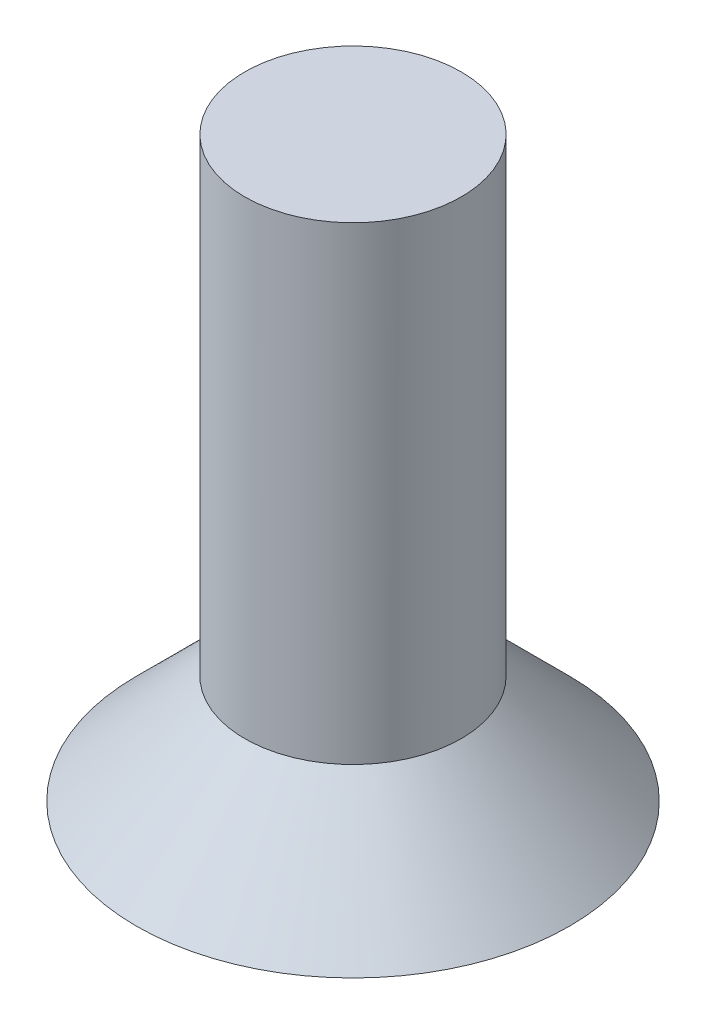
ISO-10303-21;
HEADER;
FILE_DESCRIPTION(('STEP AP214'),'2;1');
FILE_NAME('part.step','',(''),(''),'','','');
FILE_SCHEMA(('AUTOMOTIVE_DESIGN { 1 0 10303 214 1 1 1 1 }'));
ENDSEC;
DATA;
#1=APPLICATION_CONTEXT('core data for automotive mechanical design processes');
#2=APPLICATION_PROTOCOL_DEFINITION('international standard','automotive_design',2000,#1);
#3=PRODUCT_CONTEXT('',#1,'mechanical');
#4=PRODUCT('Part','Part','',(#3));
#5=PRODUCT_RELATED_PRODUCT_CATEGORY('part','',(#4));
#6=PRODUCT_DEFINITION_FORMATION('','',#4);
#7=PRODUCT_DEFINITION_CONTEXT('part definition',#1,'design');
#8=PRODUCT_DEFINITION('design','',#6,#7);
#9=PRODUCT_DEFINITION_SHAPE('','',#8);
#10=(LENGTH_UNIT() NAMED_UNIT(*) SI_UNIT(.MILLI.,.METRE.));
#11=(NAMED_UNIT(*) PLANE_ANGLE_UNIT() SI_UNIT($,.RADIAN.));
#12=(NAMED_UNIT(*) SI_UNIT($,.STERADIAN.) SOLID_ANGLE_UNIT());
#13=UNCERTAINTY_MEASURE_WITH_UNIT(LENGTH_MEASURE(1.E-05),#10,'distance_accuracy_value','');
#14=(GEOMETRIC_REPRESENTATION_CONTEXT(3) GLOBAL_UNCERTAINTY_ASSIGNED_CONTEXT((#13)) GLOBAL_UNIT_ASSIGNED_CONTEXT((#10,
#11,#12)) REPRESENTATION_CONTEXT('',''));
#15=CARTESIAN_POINT('',(0.,0.,0.));
#16=DIRECTION('',(0.,0.,1.));
#17=DIRECTION('',(1.,0.,0.));
#18=AXIS2_PLACEMENT_3D('',#15,#16,#17);
#19=CARTESIAN_POINT('',(0.,0.,0.));
#20=DIRECTION('',(0.,1.,0.));
#21=DIRECTION('',(0.,0.,1.));
#22=AXIS2_PLACEMENT_3D('',#19,#20,#21);
#23=PLANE('',#22);
#24=DIRECTION('',(0.0982131275601408,0.,0.995165404128809));
#25=VECTOR('',#24,1.);
#26=CARTESIAN_POINT('',(1.25119191093859,0.,-0.896964433103515));
#27=LINE('',#26,#25);
#28=CARTESIAN_POINT('',(1.25119191093859,0.,-0.896964433103515));
#29=VERTEX_POINT('',#28);
#30=CARTESIAN_POINT('',(1.40238994082805,0.,0.635081763330662));
#31=VERTEX_POINT('',#30);
#32=EDGE_CURVE('E125',#29,#31,#27,.T.);
#33=ORIENTED_EDGE('',*,*,#32,.F.);
#34=DIRECTION('',(0.910945084723026,0.,0.412527638612201));
#35=VECTOR('',#34,1.);
#36=CARTESIAN_POINT('',(-0.151198029889454,0.,-1.53204619643418));
#37=LINE('',#36,#35);
#38=CARTESIAN_POINT('',(-0.151198029889454,0.,-1.53204619643418));
#39=VERTEX_POINT('',#38);
#40=EDGE_CURVE('E51',#39,#29,#37,.T.);
#41=ORIENTED_EDGE('',*,*,#40,.F.);
#42=DIRECTION('',(0.812731957162885,0.,-0.582637765516608));
#43=VECTOR('',#42,1.);
#44=CARTESIAN_POINT('',(-1.40238994082805,0.,-0.635081763330661));
#45=LINE('',#44,#43);
#46=CARTESIAN_POINT('',(-1.40238994082805,0.,-0.635081763330661));
#47=VERTEX_POINT('',#46);
#48=EDGE_CURVE('E134',#47,#39,#45,.T.);
#49=ORIENTED_EDGE('',*,*,#48,.F.);
#50=DIRECTION('',(-0.098213127560141,0.,-0.995165404128809));
#51=VECTOR('',#50,1.);
#52=CARTESIAN_POINT('',(-1.25119191093859,0.,0.896964433103515));
#53=LINE('',#52,#51);
#54=CARTESIAN_POINT('',(-1.25119191093859,0.,0.896964433103515));
#55=VERTEX_POINT('',#54);
#56=EDGE_CURVE('E132',#55,#47,#53,.T.);
#57=ORIENTED_EDGE('',*,*,#56,.F.);
#58=DIRECTION('',(-0.910945084723026,0.,-0.412527638612201));
#59=VECTOR('',#58,1.);
#60=CARTESIAN_POINT('',(0.151198029889454,0.,1.53204619643418));
#61=LINE('',#60,#59);
#62=CARTESIAN_POINT('',(0.151198029889454,0.,1.53204619643418));
#63=VERTEX_POINT('',#62);
#64=EDGE_CURVE('E99',#63,#55,#61,.T.);
#65=ORIENTED_EDGE('',*,*,#64,.F.);
#66=DIRECTION('',(-0.812731957162885,0.,0.582637765516608));
#67=VECTOR('',#66,1.);
#68=CARTESIAN_POINT('',(1.40238994082805,0.,0.635081763330662));
#69=LINE('',#68,#67);
#70=EDGE_CURVE('E128',#31,#63,#69,.T.);
#71=ORIENTED_EDGE('',*,*,#70,.F.);
#72=EDGE_LOOP('',(#33,#41,#49,#57,#65,#71));
#73=FACE_BOUND('',#72,.T.);
#74=CARTESIAN_POINT('',(0.,0.,0.));
#75=DIRECTION('',(0.,1.,0.));
#76=DIRECTION('',(0.,0.,1.));
#77=AXIS2_PLACEMENT_3D('',#74,#75,#76);
#78=CIRCLE('',#77,3.);
#79=CARTESIAN_POINT('',(0.,0.,3.));
#80=VERTEX_POINT('',#79);
#81=EDGE_CURVE('E44',#80,#80,#78,.T.);
#82=ORIENTED_EDGE('',*,*,#81,.F.);
#83=EDGE_LOOP('',(#82));
#84=FACE_BOUND('',#83,.T.);
#85=ADVANCED_FACE('F35',(#73,#84),#23,.F.);
#86=CARTESIAN_POINT('',(0.,8.,0.));
#87=DIRECTION('',(0.,-1.,0.));
#88=DIRECTION('',(0.,0.,-1.));
#89=AXIS2_PLACEMENT_3D('',#86,#87,#88);
#90=CYLINDRICAL_SURFACE('',#89,1.5);
#91=CARTESIAN_POINT('',(0.,1.49999999999997,0.));
#92=DIRECTION('',(0.,-1.,0.));
#93=DIRECTION('',(0.,0.,-1.));
#94=AXIS2_PLACEMENT_3D('',#91,#92,#93);
#95=CIRCLE('',#94,1.5);
#96=CARTESIAN_POINT('',(0.,1.49999999999997,-1.5));
#97=VERTEX_POINT('',#96);
#98=EDGE_CURVE('E11',#97,#97,#95,.F.);
#99=ORIENTED_EDGE('',*,*,#98,.T.);
#100=EDGE_LOOP('',(#99));
#101=FACE_BOUND('',#100,.T.);
#102=CARTESIAN_POINT('',(0.,8.,0.));
#103=DIRECTION('',(0.,1.,0.));
#104=DIRECTION('',(0.,0.,1.));
#105=AXIS2_PLACEMENT_3D('',#102,#103,#104);
#106=CIRCLE('',#105,1.5);
#107=CARTESIAN_POINT('',(0.,8.,1.5));
#108=VERTEX_POINT('',#107);
#109=EDGE_CURVE('E138',#108,#108,#106,.T.);
#110=ORIENTED_EDGE('',*,*,#109,.F.);
#111=EDGE_LOOP('',(#110));
#112=FACE_BOUND('',#111,.T.);
#113=ADVANCED_FACE('F151',(#101,#112),#90,.T.);
#114=CARTESIAN_POINT('',(0.,8.,0.));
#115=DIRECTION('',(0.,1.,0.));
#116=DIRECTION('',(0.,0.,1.));
#117=AXIS2_PLACEMENT_3D('',#114,#115,#116);
#118=PLANE('',#117);
#119=ORIENTED_EDGE('',*,*,#109,.T.);
#120=EDGE_LOOP('',(#119));
#121=FACE_BOUND('',#120,.T.);
#122=ADVANCED_FACE('F158',(#121),#118,.T.);
#123=CARTESIAN_POINT('',(0.,2.5,0.));
#124=DIRECTION('',(0.,-1.,0.));
#125=DIRECTION('',(0.,0.,-1.));
#126=AXIS2_PLACEMENT_3D('',#123,#124,#125);
#127=CONICAL_SURFACE('',#126,0.499999999999957,0.785398163397453);
#128=ORIENTED_EDGE('',*,*,#81,.T.);
#129=EDGE_LOOP('',(#128));
#130=FACE_BOUND('',#129,.T.);
#131=ORIENTED_EDGE('',*,*,#98,.F.);
#132=EDGE_LOOP('',(#131));
#133=FACE_BOUND('',#132,.T.);
#134=ADVANCED_FACE('F38',(#130,#133),#127,.T.);
#135=CARTESIAN_POINT('',(-0.151198029889454,1.,-1.53204619643418));
#136=DIRECTION('',(0.412527638612201,0.,-0.910945084723026));
#137=DIRECTION('',(-0.910945084723026,0.,-0.412527638612201));
#138=AXIS2_PLACEMENT_3D('',#135,#136,#137);
#139=PLANE('',#138);
#140=ORIENTED_EDGE('',*,*,#40,.T.);
#141=DIRECTION('',(0.,-1.,0.));
#142=VECTOR('',#141,1.);
#143=CARTESIAN_POINT('',(1.25119191093859,1.,-0.896964433103515));
#144=LINE('',#143,#142);
#145=CARTESIAN_POINT('',(1.25119191093859,1.,-0.896964433103515));
#146=VERTEX_POINT('',#145);
#147=EDGE_CURVE('E81',#146,#29,#144,.T.);
#148=ORIENTED_EDGE('',*,*,#147,.F.);
#149=DIRECTION('',(0.910945084723026,0.,0.412527638612201));
#150=VECTOR('',#149,1.);
#151=CARTESIAN_POINT('',(-0.151198029889454,1.,-1.53204619643418));
#152=LINE('',#151,#150);
#153=CARTESIAN_POINT('',(-0.151198029889454,1.,-1.53204619643418));
#154=VERTEX_POINT('',#153);
#155=EDGE_CURVE('E136',#154,#146,#152,.T.);
#156=ORIENTED_EDGE('',*,*,#155,.F.);
#157=DIRECTION('',(0.,-1.,0.));
#158=VECTOR('',#157,1.);
#159=CARTESIAN_POINT('',(-0.151198029889454,1.,-1.53204619643418));
#160=LINE('',#159,#158);
#161=EDGE_CURVE('E59',#154,#39,#160,.T.);
#162=ORIENTED_EDGE('',*,*,#161,.T.);
#163=EDGE_LOOP('',(#140,#148,#156,#162));
#164=FACE_BOUND('',#163,.T.);
#165=ADVANCED_FACE('F166',(#164),#139,.F.);
#166=CARTESIAN_POINT('',(-1.40238994082805,1.,-0.635081763330661));
#167=DIRECTION('',(-0.582637765516608,0.,-0.812731957162885));
#168=DIRECTION('',(-0.812731957162885,0.,0.582637765516608));
#169=AXIS2_PLACEMENT_3D('',#166,#167,#168);
#170=PLANE('',#169);
#171=ORIENTED_EDGE('',*,*,#48,.T.);
#172=ORIENTED_EDGE('',*,*,#161,.F.);
#173=DIRECTION('',(0.812731957162885,0.,-0.582637765516608));
#174=VECTOR('',#173,1.);
#175=CARTESIAN_POINT('',(-1.40238994082805,1.,-0.635081763330661));
#176=LINE('',#175,#174);
#177=CARTESIAN_POINT('',(-1.40238994082805,1.,-0.635081763330661));
#178=VERTEX_POINT('',#177);
#179=EDGE_CURVE('E111',#178,#154,#176,.T.);
#180=ORIENTED_EDGE('',*,*,#179,.F.);
#181=DIRECTION('',(0.,-1.,0.));
#182=VECTOR('',#181,1.);
#183=CARTESIAN_POINT('',(-1.40238994082805,1.,-0.635081763330661));
#184=LINE('',#183,#182);
#185=EDGE_CURVE('E103',#178,#47,#184,.T.);
#186=ORIENTED_EDGE('',*,*,#185,.T.);
#187=EDGE_LOOP('',(#171,#172,#180,#186));
#188=FACE_BOUND('',#187,.T.);
#189=ADVANCED_FACE('F169',(#188),#170,.F.);
#190=CARTESIAN_POINT('',(-1.25119191093859,1.,0.896964433103515));
#191=DIRECTION('',(-0.995165404128809,0.,0.098213127560141));
#192=DIRECTION('',(0.098213127560141,0.,0.995165404128809));
#193=AXIS2_PLACEMENT_3D('',#190,#191,#192);
#194=PLANE('',#193);
#195=ORIENTED_EDGE('',*,*,#56,.T.);
#196=ORIENTED_EDGE('',*,*,#185,.F.);
#197=DIRECTION('',(-0.098213127560141,0.,-0.995165404128809));
#198=VECTOR('',#197,1.);
#199=CARTESIAN_POINT('',(-1.25119191093859,1.,0.896964433103515));
#200=LINE('',#199,#198);
#201=CARTESIAN_POINT('',(-1.25119191093859,1.,0.896964433103515));
#202=VERTEX_POINT('',#201);
#203=EDGE_CURVE('E107',#202,#178,#200,.T.);
#204=ORIENTED_EDGE('',*,*,#203,.F.);
#205=DIRECTION('',(0.,-1.,0.));
#206=VECTOR('',#205,1.);
#207=CARTESIAN_POINT('',(-1.25119191093859,1.,0.896964433103515));
#208=LINE('',#207,#206);
#209=EDGE_CURVE('E92',#202,#55,#208,.T.);
#210=ORIENTED_EDGE('',*,*,#209,.T.);
#211=EDGE_LOOP('',(#195,#196,#204,#210));
#212=FACE_BOUND('',#211,.T.);
#213=ADVANCED_FACE('F108',(#212),#194,.F.);
#214=CARTESIAN_POINT('',(0.151198029889454,1.,1.53204619643418));
#215=DIRECTION('',(-0.412527638612201,0.,0.910945084723026));
#216=DIRECTION('',(0.910945084723026,0.,0.412527638612201));
#217=AXIS2_PLACEMENT_3D('',#214,#215,#216);
#218=PLANE('',#217);
#219=ORIENTED_EDGE('',*,*,#64,.T.);
#220=ORIENTED_EDGE('',*,*,#209,.F.);
#221=DIRECTION('',(-0.910945084723026,0.,-0.412527638612201));
#222=VECTOR('',#221,1.);
#223=CARTESIAN_POINT('',(0.151198029889454,1.,1.53204619643418));
#224=LINE('',#223,#222);
#225=CARTESIAN_POINT('',(0.151198029889454,1.,1.53204619643418));
#226=VERTEX_POINT('',#225);
#227=EDGE_CURVE('E96',#226,#202,#224,.T.);
#228=ORIENTED_EDGE('',*,*,#227,.F.);
#229=DIRECTION('',(0.,-1.,0.));
#230=VECTOR('',#229,1.);
#231=CARTESIAN_POINT('',(0.151198029889454,1.,1.53204619643418));
#232=LINE('',#231,#230);
#233=EDGE_CURVE('E104',#226,#63,#232,.T.);
#234=ORIENTED_EDGE('',*,*,#233,.T.);
#235=EDGE_LOOP('',(#219,#220,#228,#234));
#236=FACE_BOUND('',#235,.T.);
#237=ADVANCED_FACE('F94',(#236),#218,.F.);
#238=CARTESIAN_POINT('',(1.40238994082805,1.,0.635081763330662));
#239=DIRECTION('',(0.582637765516608,0.,0.812731957162885));
#240=DIRECTION('',(0.812731957162885,0.,-0.582637765516608));
#241=AXIS2_PLACEMENT_3D('',#238,#239,#240);
#242=PLANE('',#241);
#243=ORIENTED_EDGE('',*,*,#70,.T.);
#244=ORIENTED_EDGE('',*,*,#233,.F.);
#245=DIRECTION('',(-0.812731957162885,0.,0.582637765516608));
#246=VECTOR('',#245,1.);
#247=CARTESIAN_POINT('',(1.40238994082805,1.,0.635081763330662));
#248=LINE('',#247,#246);
#249=CARTESIAN_POINT('',(1.40238994082805,1.,0.635081763330662));
#250=VERTEX_POINT('',#249);
#251=EDGE_CURVE('E117',#250,#226,#248,.T.);
#252=ORIENTED_EDGE('',*,*,#251,.F.);
#253=DIRECTION('',(0.,-1.,0.));
#254=VECTOR('',#253,1.);
#255=CARTESIAN_POINT('',(1.40238994082805,1.,0.635081763330662));
#256=LINE('',#255,#254);
#257=EDGE_CURVE('E141',#250,#31,#256,.T.);
#258=ORIENTED_EDGE('',*,*,#257,.T.);
#259=EDGE_LOOP('',(#243,#244,#252,#258));
#260=FACE_BOUND('',#259,.T.);
#261=ADVANCED_FACE('F173',(#260),#242,.F.);
#262=CARTESIAN_POINT('',(1.25119191093859,1.,-0.896964433103515));
#263=DIRECTION('',(0.995165404128809,0.,-0.0982131275601408));
#264=DIRECTION('',(-0.0982131275601409,0.,-0.995165404128809));
#265=AXIS2_PLACEMENT_3D('',#262,#263,#264);
#266=PLANE('',#265);
#267=ORIENTED_EDGE('',*,*,#32,.T.);
#268=ORIENTED_EDGE('',*,*,#257,.F.);
#269=DIRECTION('',(0.0982131275601408,0.,0.995165404128809));
#270=VECTOR('',#269,1.);
#271=CARTESIAN_POINT('',(1.25119191093859,1.,-0.896964433103515));
#272=LINE('',#271,#270);
#273=EDGE_CURVE('E119',#146,#250,#272,.T.);
#274=ORIENTED_EDGE('',*,*,#273,.F.);
#275=ORIENTED_EDGE('',*,*,#147,.T.);
#276=EDGE_LOOP('',(#267,#268,#274,#275));
#277=FACE_BOUND('',#276,.T.);
#278=ADVANCED_FACE('F170',(#277),#266,.F.);
#279=CARTESIAN_POINT('',(0.,1.,0.));
#280=DIRECTION('',(0.,-1.,0.));
#281=DIRECTION('',(0.,0.,-1.));
#282=AXIS2_PLACEMENT_3D('',#279,#280,#281);
#283=PLANE('',#282);
#284=ORIENTED_EDGE('',*,*,#155,.T.);
#285=ORIENTED_EDGE('',*,*,#273,.T.);
#286=ORIENTED_EDGE('',*,*,#251,.T.);
#287=ORIENTED_EDGE('',*,*,#227,.T.);
#288=ORIENTED_EDGE('',*,*,#203,.T.);
#289=ORIENTED_EDGE('',*,*,#179,.T.);
#290=EDGE_LOOP('',(#284,#285,#286,#287,#288,#289));
#291=FACE_BOUND('',#290,.T.);
#292=ADVANCED_FACE('F114',(#291),#283,.T.);
#293=CLOSED_SHELL('',(#85,#113,#122,#134,#165,#189,#213,#237,#261,#278,#292));
#294=MANIFOLD_SOLID_BREP('B2',#293);
#295=ADVANCED_BREP_SHAPE_REPRESENTATION('',(#18,#294),#14);
#296=SHAPE_DEFINITION_REPRESENTATION(#9,#295);
ENDSEC;
END-ISO-10303-21;
